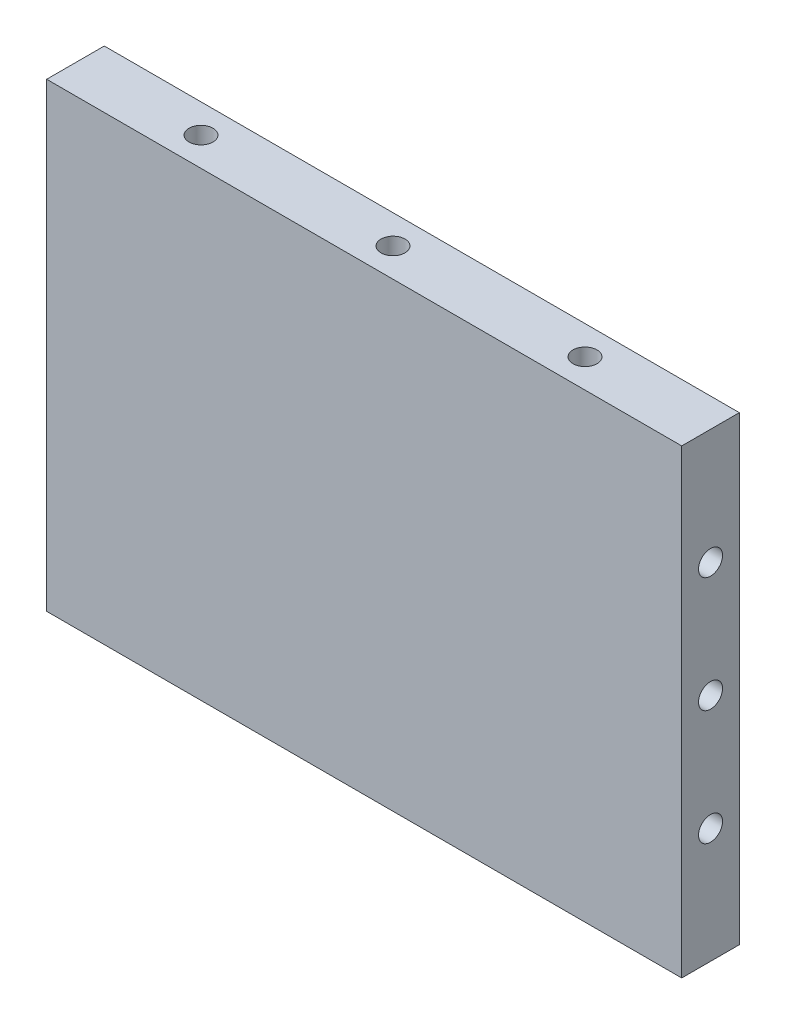
ISO-10303-21;
HEADER;
FILE_DESCRIPTION(('STEP AP214'),'2;1');
FILE_NAME('part.step','',(''),(''),'','','');
FILE_SCHEMA(('AUTOMOTIVE_DESIGN { 1 0 10303 214 1 1 1 1 }'));
ENDSEC;
DATA;
#1=APPLICATION_CONTEXT('core data for automotive mechanical design processes');
#2=APPLICATION_PROTOCOL_DEFINITION('international standard','automotive_design',2000,#1);
#3=PRODUCT_CONTEXT('',#1,'mechanical');
#4=PRODUCT('Part','Part','',(#3));
#5=PRODUCT_RELATED_PRODUCT_CATEGORY('part','',(#4));
#6=PRODUCT_DEFINITION_FORMATION('','',#4);
#7=PRODUCT_DEFINITION_CONTEXT('part definition',#1,'design');
#8=PRODUCT_DEFINITION('design','',#6,#7);
#9=PRODUCT_DEFINITION_SHAPE('','',#8);
#10=(LENGTH_UNIT() NAMED_UNIT(*) SI_UNIT(.MILLI.,.METRE.));
#11=(NAMED_UNIT(*) PLANE_ANGLE_UNIT() SI_UNIT($,.RADIAN.));
#12=(NAMED_UNIT(*) SI_UNIT($,.STERADIAN.) SOLID_ANGLE_UNIT());
#13=UNCERTAINTY_MEASURE_WITH_UNIT(LENGTH_MEASURE(1.E-05),#10,'distance_accuracy_value','');
#14=(GEOMETRIC_REPRESENTATION_CONTEXT(3) GLOBAL_UNCERTAINTY_ASSIGNED_CONTEXT((#13)) GLOBAL_UNIT_ASSIGNED_CONTEXT((#10,
#11,#12)) REPRESENTATION_CONTEXT('',''));
#15=CARTESIAN_POINT('',(0.,0.,0.));
#16=DIRECTION('',(0.,0.,1.));
#17=DIRECTION('',(1.,0.,0.));
#18=AXIS2_PLACEMENT_3D('',#15,#16,#17);
#19=CARTESIAN_POINT('',(-33.075,0.,2.99999999999295));
#20=DIRECTION('',(-1.,0.,0.));
#21=DIRECTION('',(0.,0.,1.));
#22=AXIS2_PLACEMENT_3D('',#19,#20,#21);
#23=CYLINDRICAL_SURFACE('',#22,1.24999999999999);
#24=CARTESIAN_POINT('',(0.,0.,2.99999999999648));
#25=DIRECTION('',(-0.707106781186547,-0.707106781186547,0.));
#26=DIRECTION('',(-0.707106781186547,0.707106781186547,0.));
#27=AXIS2_PLACEMENT_3D('',#24,#25,#26);
#28=ELLIPSE('',#27,1.76776695296635,1.24999999999999);
#29=CARTESIAN_POINT('',(0.,0.,1.74999999999649));
#30=VERTEX_POINT('',#29);
#31=CARTESIAN_POINT('',(0.,0.,4.24999999999646));
#32=VERTEX_POINT('',#31);
#33=EDGE_CURVE('E266',#30,#32,#28,.T.);
#34=ORIENTED_EDGE('',*,*,#33,.T.);
#35=CARTESIAN_POINT('',(0.,0.,2.99999999999648));
#36=DIRECTION('',(-0.707106781186547,0.707106781186547,0.));
#37=DIRECTION('',(-0.707106781186547,-0.707106781186547,0.));
#38=AXIS2_PLACEMENT_3D('',#35,#36,#37);
#39=ELLIPSE('',#38,1.76776695296635,1.24999999999999);
#40=EDGE_CURVE('E262',#32,#30,#39,.T.);
#41=ORIENTED_EDGE('',*,*,#40,.T.);
#42=EDGE_LOOP('',(#34,#41));
#43=FACE_BOUND('',#42,.T.);
#44=CARTESIAN_POINT('',(20.,0.,2.99999999999648));
#45=DIRECTION('',(-0.707106781186547,-0.707106781186547,0.));
#46=DIRECTION('',(-0.707106781186547,0.707106781186547,0.));
#47=AXIS2_PLACEMENT_3D('',#44,#45,#46);
#48=ELLIPSE('',#47,1.76776695296635,1.24999999999999);
#49=CARTESIAN_POINT('',(20.,0.,1.74999999999649));
#50=VERTEX_POINT('',#49);
#51=CARTESIAN_POINT('',(20.,0.,4.24999999999646));
#52=VERTEX_POINT('',#51);
#53=EDGE_CURVE('E59',#50,#52,#48,.F.);
#54=ORIENTED_EDGE('',*,*,#53,.T.);
#55=CARTESIAN_POINT('',(20.,0.,2.99999999999648));
#56=DIRECTION('',(-0.707106781186547,0.707106781186547,0.));
#57=DIRECTION('',(-0.707106781186547,-0.707106781186547,0.));
#58=AXIS2_PLACEMENT_3D('',#55,#56,#57);
#59=ELLIPSE('',#58,1.76776695296635,1.24999999999999);
#60=EDGE_CURVE('E334',#52,#50,#59,.F.);
#61=ORIENTED_EDGE('',*,*,#60,.T.);
#62=EDGE_LOOP('',(#54,#61));
#63=FACE_BOUND('',#62,.T.);
#64=ADVANCED_FACE('F44',(#43,#63),#23,.F.);
#65=CARTESIAN_POINT('',(-33.075,12.,3.));
#66=DIRECTION('',(-1.,0.,0.));
#67=DIRECTION('',(0.,0.,1.));
#68=AXIS2_PLACEMENT_3D('',#65,#66,#67);
#69=CYLINDRICAL_SURFACE('',#68,1.24999999999999);
#70=CARTESIAN_POINT('',(0.,12.,3.));
#71=DIRECTION('',(-0.707106781186547,-0.707106781186547,0.));
#72=DIRECTION('',(-0.707106781186547,0.707106781186547,0.));
#73=AXIS2_PLACEMENT_3D('',#70,#71,#72);
#74=ELLIPSE('',#73,1.76776695296635,1.24999999999999);
#75=CARTESIAN_POINT('',(0.,12.,1.75000000000001));
#76=VERTEX_POINT('',#75);
#77=CARTESIAN_POINT('',(0.,12.,4.24999999999999));
#78=VERTEX_POINT('',#77);
#79=EDGE_CURVE('E185',#76,#78,#74,.T.);
#80=ORIENTED_EDGE('',*,*,#79,.T.);
#81=CARTESIAN_POINT('',(0.,12.,3.));
#82=DIRECTION('',(-0.707106781186547,0.707106781186547,0.));
#83=DIRECTION('',(-0.707106781186547,-0.707106781186547,0.));
#84=AXIS2_PLACEMENT_3D('',#81,#82,#83);
#85=ELLIPSE('',#84,1.76776695296635,1.24999999999999);
#86=EDGE_CURVE('E181',#78,#76,#85,.T.);
#87=ORIENTED_EDGE('',*,*,#86,.T.);
#88=EDGE_LOOP('',(#80,#87));
#89=FACE_BOUND('',#88,.T.);
#90=CARTESIAN_POINT('',(20.,12.,3.));
#91=DIRECTION('',(-0.707106781186547,-0.707106781186547,0.));
#92=DIRECTION('',(-0.707106781186547,0.707106781186547,0.));
#93=AXIS2_PLACEMENT_3D('',#90,#91,#92);
#94=ELLIPSE('',#93,1.76776695296635,1.24999999999999);
#95=CARTESIAN_POINT('',(20.,12.,1.75000000000001));
#96=VERTEX_POINT('',#95);
#97=CARTESIAN_POINT('',(20.,12.,4.24999999999999));
#98=VERTEX_POINT('',#97);
#99=EDGE_CURVE('E66',#96,#98,#94,.F.);
#100=ORIENTED_EDGE('',*,*,#99,.T.);
#101=CARTESIAN_POINT('',(20.,12.,3.));
#102=DIRECTION('',(-0.707106781186547,0.707106781186547,0.));
#103=DIRECTION('',(-0.707106781186547,-0.707106781186547,0.));
#104=AXIS2_PLACEMENT_3D('',#101,#102,#103);
#105=ELLIPSE('',#104,1.76776695296635,1.24999999999999);
#106=EDGE_CURVE('E347',#98,#96,#105,.F.);
#107=ORIENTED_EDGE('',*,*,#106,.T.);
#108=EDGE_LOOP('',(#100,#107));
#109=FACE_BOUND('',#108,.T.);
#110=ADVANCED_FACE('F411',(#89,#109),#69,.F.);
#111=CARTESIAN_POINT('',(-33.075,-12.,3.));
#112=DIRECTION('',(-1.,0.,0.));
#113=DIRECTION('',(0.,0.,1.));
#114=AXIS2_PLACEMENT_3D('',#111,#112,#113);
#115=CYLINDRICAL_SURFACE('',#114,1.24999999999999);
#116=CARTESIAN_POINT('',(0.,-12.,3.));
#117=DIRECTION('',(-0.707106781186547,-0.707106781186547,0.));
#118=DIRECTION('',(-0.707106781186547,0.707106781186547,0.));
#119=AXIS2_PLACEMENT_3D('',#116,#117,#118);
#120=ELLIPSE('',#119,1.76776695296635,1.24999999999999);
#121=CARTESIAN_POINT('',(0.,-12.,1.75000000000001));
#122=VERTEX_POINT('',#121);
#123=CARTESIAN_POINT('',(0.,-12.,4.24999999999999));
#124=VERTEX_POINT('',#123);
#125=EDGE_CURVE('E281',#122,#124,#120,.T.);
#126=ORIENTED_EDGE('',*,*,#125,.T.);
#127=CARTESIAN_POINT('',(0.,-12.,3.));
#128=DIRECTION('',(-0.707106781186547,0.707106781186547,0.));
#129=DIRECTION('',(-0.707106781186547,-0.707106781186547,0.));
#130=AXIS2_PLACEMENT_3D('',#127,#128,#129);
#131=ELLIPSE('',#130,1.76776695296635,1.24999999999999);
#132=EDGE_CURVE('E277',#124,#122,#131,.T.);
#133=ORIENTED_EDGE('',*,*,#132,.T.);
#134=EDGE_LOOP('',(#126,#133));
#135=FACE_BOUND('',#134,.T.);
#136=CARTESIAN_POINT('',(20.,-12.,3.));
#137=DIRECTION('',(-0.707106781186547,-0.707106781186547,0.));
#138=DIRECTION('',(-0.707106781186547,0.707106781186547,0.));
#139=AXIS2_PLACEMENT_3D('',#136,#137,#138);
#140=ELLIPSE('',#139,1.76776695296635,1.24999999999999);
#141=CARTESIAN_POINT('',(20.,-12.,1.75000000000001));
#142=VERTEX_POINT('',#141);
#143=CARTESIAN_POINT('',(20.,-12.,4.24999999999999));
#144=VERTEX_POINT('',#143);
#145=EDGE_CURVE('E148',#142,#144,#140,.F.);
#146=ORIENTED_EDGE('',*,*,#145,.T.);
#147=CARTESIAN_POINT('',(20.,-12.,3.));
#148=DIRECTION('',(-0.707106781186547,0.707106781186547,0.));
#149=DIRECTION('',(-0.707106781186547,-0.707106781186547,0.));
#150=AXIS2_PLACEMENT_3D('',#147,#148,#149);
#151=ELLIPSE('',#150,1.76776695296635,1.24999999999999);
#152=EDGE_CURVE('E11',#144,#142,#151,.F.);
#153=ORIENTED_EDGE('',*,*,#152,.T.);
#154=EDGE_LOOP('',(#146,#153));
#155=FACE_BOUND('',#154,.T.);
#156=ADVANCED_FACE('F158',(#135,#155),#115,.F.);
#157=CARTESIAN_POINT('',(-33.075,0.,2.99999999999295));
#158=DIRECTION('',(-1.,0.,0.));
#159=DIRECTION('',(0.,0.,1.));
#160=AXIS2_PLACEMENT_3D('',#157,#158,#159);
#161=CIRCLE('',#160,1.24999999999999);
#162=CARTESIAN_POINT('',(-33.075,0.,4.24999999999294));
#163=VERTEX_POINT('',#162);
#164=EDGE_CURVE('E238',#163,#163,#161,.T.);
#165=ORIENTED_EDGE('',*,*,#164,.T.);
#166=EDGE_LOOP('',(#165));
#167=FACE_BOUND('',#166,.T.);
#168=CARTESIAN_POINT('',(-20.,0.,2.99999999999648));
#169=DIRECTION('',(-0.707106781186547,-0.707106781186547,0.));
#170=DIRECTION('',(-0.707106781186547,0.707106781186547,0.));
#171=AXIS2_PLACEMENT_3D('',#168,#169,#170);
#172=ELLIPSE('',#171,1.76776695296635,1.24999999999999);
#173=CARTESIAN_POINT('',(-20.,0.,1.74999999999649));
#174=VERTEX_POINT('',#173);
#175=CARTESIAN_POINT('',(-20.,0.,4.24999999999646));
#176=VERTEX_POINT('',#175);
#177=EDGE_CURVE('E308',#174,#176,#172,.F.);
#178=ORIENTED_EDGE('',*,*,#177,.T.);
#179=CARTESIAN_POINT('',(-20.,0.,2.99999999999648));
#180=DIRECTION('',(-0.707106781186547,0.707106781186547,0.));
#181=DIRECTION('',(-0.707106781186547,-0.707106781186547,0.));
#182=AXIS2_PLACEMENT_3D('',#179,#180,#181);
#183=ELLIPSE('',#182,1.76776695296635,1.24999999999999);
#184=EDGE_CURVE('E296',#176,#174,#183,.F.);
#185=ORIENTED_EDGE('',*,*,#184,.T.);
#186=EDGE_LOOP('',(#178,#185));
#187=FACE_BOUND('',#186,.T.);
#188=ADVANCED_FACE('F413',(#167,#187),#23,.F.);
#189=CARTESIAN_POINT('',(-33.075,-12.,3.));
#190=DIRECTION('',(-1.,0.,0.));
#191=DIRECTION('',(0.,0.,1.));
#192=AXIS2_PLACEMENT_3D('',#189,#190,#191);
#193=CIRCLE('',#192,1.24999999999999);
#194=CARTESIAN_POINT('',(-33.075,-12.,4.24999999999999));
#195=VERTEX_POINT('',#194);
#196=EDGE_CURVE('E246',#195,#195,#193,.T.);
#197=ORIENTED_EDGE('',*,*,#196,.T.);
#198=EDGE_LOOP('',(#197));
#199=FACE_BOUND('',#198,.T.);
#200=CARTESIAN_POINT('',(-20.,-12.,3.));
#201=DIRECTION('',(-0.707106781186547,-0.707106781186547,0.));
#202=DIRECTION('',(-0.707106781186547,0.707106781186547,0.));
#203=AXIS2_PLACEMENT_3D('',#200,#201,#202);
#204=ELLIPSE('',#203,1.76776695296635,1.24999999999999);
#205=CARTESIAN_POINT('',(-20.,-12.,1.75000000000001));
#206=VERTEX_POINT('',#205);
#207=CARTESIAN_POINT('',(-20.,-12.,4.24999999999999));
#208=VERTEX_POINT('',#207);
#209=EDGE_CURVE('E323',#206,#208,#204,.F.);
#210=ORIENTED_EDGE('',*,*,#209,.T.);
#211=CARTESIAN_POINT('',(-20.,-12.,3.));
#212=DIRECTION('',(-0.707106781186547,0.707106781186547,0.));
#213=DIRECTION('',(-0.707106781186547,-0.707106781186547,0.));
#214=AXIS2_PLACEMENT_3D('',#211,#212,#213);
#215=ELLIPSE('',#214,1.76776695296635,1.24999999999999);
#216=EDGE_CURVE('E311',#208,#206,#215,.F.);
#217=ORIENTED_EDGE('',*,*,#216,.T.);
#218=EDGE_LOOP('',(#210,#217));
#219=FACE_BOUND('',#218,.T.);
#220=ADVANCED_FACE('F424',(#199,#219),#115,.F.);
#221=CARTESIAN_POINT('',(-33.075,12.,3.));
#222=DIRECTION('',(-1.,0.,0.));
#223=DIRECTION('',(0.,0.,1.));
#224=AXIS2_PLACEMENT_3D('',#221,#222,#223);
#225=CIRCLE('',#224,1.24999999999999);
#226=CARTESIAN_POINT('',(-33.075,12.,4.24999999999999));
#227=VERTEX_POINT('',#226);
#228=EDGE_CURVE('E254',#227,#227,#225,.T.);
#229=ORIENTED_EDGE('',*,*,#228,.T.);
#230=EDGE_LOOP('',(#229));
#231=FACE_BOUND('',#230,.T.);
#232=CARTESIAN_POINT('',(-20.,12.,3.));
#233=DIRECTION('',(-0.707106781186547,-0.707106781186547,0.));
#234=DIRECTION('',(-0.707106781186547,0.707106781186547,0.));
#235=AXIS2_PLACEMENT_3D('',#232,#233,#234);
#236=ELLIPSE('',#235,1.76776695296635,1.24999999999999);
#237=CARTESIAN_POINT('',(-20.,12.,1.75000000000001));
#238=VERTEX_POINT('',#237);
#239=CARTESIAN_POINT('',(-20.,12.,4.24999999999999));
#240=VERTEX_POINT('',#239);
#241=EDGE_CURVE('E174',#238,#240,#236,.F.);
#242=ORIENTED_EDGE('',*,*,#241,.T.);
#243=CARTESIAN_POINT('',(-20.,12.,3.));
#244=DIRECTION('',(-0.707106781186547,0.707106781186547,0.));
#245=DIRECTION('',(-0.707106781186547,-0.707106781186547,0.));
#246=AXIS2_PLACEMENT_3D('',#243,#244,#245);
#247=ELLIPSE('',#246,1.76776695296635,1.24999999999999);
#248=EDGE_CURVE('E156',#240,#238,#247,.F.);
#249=ORIENTED_EDGE('',*,*,#248,.T.);
#250=EDGE_LOOP('',(#242,#249));
#251=FACE_BOUND('',#250,.T.);
#252=ADVANCED_FACE('F420',(#231,#251),#69,.F.);
#253=CARTESIAN_POINT('',(-20.,0.,2.99999999999648));
#254=DIRECTION('',(-0.707106781186547,-0.707106781186547,0.));
#255=DIRECTION('',(-0.707106781186547,0.707106781186547,0.));
#256=AXIS2_PLACEMENT_3D('',#253,#254,#255);
#257=ELLIPSE('',#256,1.76776695296635,1.24999999999999);
#258=EDGE_CURVE('E304',#174,#176,#257,.T.);
#259=ORIENTED_EDGE('',*,*,#258,.T.);
#260=CARTESIAN_POINT('',(-20.,0.,2.99999999999648));
#261=DIRECTION('',(-0.707106781186547,0.707106781186547,0.));
#262=DIRECTION('',(-0.707106781186547,-0.707106781186547,0.));
#263=AXIS2_PLACEMENT_3D('',#260,#261,#262);
#264=ELLIPSE('',#263,1.76776695296635,1.24999999999999);
#265=EDGE_CURVE('E300',#176,#174,#264,.T.);
#266=ORIENTED_EDGE('',*,*,#265,.T.);
#267=EDGE_LOOP('',(#259,#266));
#268=FACE_BOUND('',#267,.T.);
#269=CARTESIAN_POINT('',(0.,0.,2.99999999999648));
#270=DIRECTION('',(-0.707106781186547,-0.707106781186547,0.));
#271=DIRECTION('',(-0.707106781186547,0.707106781186547,0.));
#272=AXIS2_PLACEMENT_3D('',#269,#270,#271);
#273=ELLIPSE('',#272,1.76776695296635,1.24999999999999);
#274=EDGE_CURVE('E270',#30,#32,#273,.F.);
#275=ORIENTED_EDGE('',*,*,#274,.T.);
#276=CARTESIAN_POINT('',(0.,0.,2.99999999999648));
#277=DIRECTION('',(-0.707106781186547,0.707106781186547,0.));
#278=DIRECTION('',(-0.707106781186547,-0.707106781186547,0.));
#279=AXIS2_PLACEMENT_3D('',#276,#277,#278);
#280=ELLIPSE('',#279,1.76776695296635,1.24999999999999);
#281=EDGE_CURVE('E258',#32,#30,#280,.F.);
#282=ORIENTED_EDGE('',*,*,#281,.T.);
#283=EDGE_LOOP('',(#275,#282));
#284=FACE_BOUND('',#283,.T.);
#285=ADVANCED_FACE('F426',(#268,#284),#23,.F.);
#286=CARTESIAN_POINT('',(-20.,-12.,3.));
#287=DIRECTION('',(-0.707106781186547,-0.707106781186547,0.));
#288=DIRECTION('',(-0.707106781186547,0.707106781186547,0.));
#289=AXIS2_PLACEMENT_3D('',#286,#287,#288);
#290=ELLIPSE('',#289,1.76776695296635,1.24999999999999);
#291=EDGE_CURVE('E319',#206,#208,#290,.T.);
#292=ORIENTED_EDGE('',*,*,#291,.T.);
#293=CARTESIAN_POINT('',(-20.,-12.,3.));
#294=DIRECTION('',(-0.707106781186547,0.707106781186547,0.));
#295=DIRECTION('',(-0.707106781186547,-0.707106781186547,0.));
#296=AXIS2_PLACEMENT_3D('',#293,#294,#295);
#297=ELLIPSE('',#296,1.76776695296635,1.24999999999999);
#298=EDGE_CURVE('E315',#208,#206,#297,.T.);
#299=ORIENTED_EDGE('',*,*,#298,.T.);
#300=EDGE_LOOP('',(#292,#299));
#301=FACE_BOUND('',#300,.T.);
#302=CARTESIAN_POINT('',(0.,-12.,3.));
#303=DIRECTION('',(-0.707106781186547,-0.707106781186547,0.));
#304=DIRECTION('',(-0.707106781186547,0.707106781186547,0.));
#305=AXIS2_PLACEMENT_3D('',#302,#303,#304);
#306=ELLIPSE('',#305,1.76776695296635,1.24999999999999);
#307=EDGE_CURVE('E285',#122,#124,#306,.F.);
#308=ORIENTED_EDGE('',*,*,#307,.T.);
#309=CARTESIAN_POINT('',(0.,-12.,3.));
#310=DIRECTION('',(-0.707106781186547,0.707106781186547,0.));
#311=DIRECTION('',(-0.707106781186547,-0.707106781186547,0.));
#312=AXIS2_PLACEMENT_3D('',#309,#310,#311);
#313=ELLIPSE('',#312,1.76776695296635,1.24999999999999);
#314=EDGE_CURVE('E273',#124,#122,#313,.F.);
#315=ORIENTED_EDGE('',*,*,#314,.T.);
#316=EDGE_LOOP('',(#308,#315));
#317=FACE_BOUND('',#316,.T.);
#318=ADVANCED_FACE('F433',(#301,#317),#115,.F.);
#319=CARTESIAN_POINT('',(-20.,12.,3.));
#320=DIRECTION('',(-0.707106781186547,-0.707106781186547,0.));
#321=DIRECTION('',(-0.707106781186547,0.707106781186547,0.));
#322=AXIS2_PLACEMENT_3D('',#319,#320,#321);
#323=ELLIPSE('',#322,1.76776695296635,1.24999999999999);
#324=EDGE_CURVE('E170',#238,#240,#323,.T.);
#325=ORIENTED_EDGE('',*,*,#324,.T.);
#326=CARTESIAN_POINT('',(-20.,12.,3.));
#327=DIRECTION('',(-0.707106781186547,0.707106781186547,0.));
#328=DIRECTION('',(-0.707106781186547,-0.707106781186547,0.));
#329=AXIS2_PLACEMENT_3D('',#326,#327,#328);
#330=ELLIPSE('',#329,1.76776695296635,1.24999999999999);
#331=EDGE_CURVE('E166',#240,#238,#330,.T.);
#332=ORIENTED_EDGE('',*,*,#331,.T.);
#333=EDGE_LOOP('',(#325,#332));
#334=FACE_BOUND('',#333,.T.);
#335=CARTESIAN_POINT('',(0.,12.,3.));
#336=DIRECTION('',(-0.707106781186547,-0.707106781186547,0.));
#337=DIRECTION('',(-0.707106781186547,0.707106781186547,0.));
#338=AXIS2_PLACEMENT_3D('',#335,#336,#337);
#339=ELLIPSE('',#338,1.76776695296635,1.24999999999999);
#340=EDGE_CURVE('E189',#76,#78,#339,.F.);
#341=ORIENTED_EDGE('',*,*,#340,.T.);
#342=CARTESIAN_POINT('',(0.,12.,3.));
#343=DIRECTION('',(-0.707106781186547,0.707106781186547,0.));
#344=DIRECTION('',(-0.707106781186547,-0.707106781186547,0.));
#345=AXIS2_PLACEMENT_3D('',#342,#343,#344);
#346=ELLIPSE('',#345,1.76776695296635,1.24999999999999);
#347=EDGE_CURVE('E177',#78,#76,#346,.F.);
#348=ORIENTED_EDGE('',*,*,#347,.T.);
#349=EDGE_LOOP('',(#341,#348));
#350=FACE_BOUND('',#349,.T.);
#351=ADVANCED_FACE('F441',(#334,#350),#69,.F.);
#352=CARTESIAN_POINT('',(33.075,-24.,6.));
#353=DIRECTION('',(-1.,0.,0.));
#354=DIRECTION('',(0.,0.,1.));
#355=AXIS2_PLACEMENT_3D('',#352,#353,#354);
#356=PLANE('',#355);
#357=CARTESIAN_POINT('',(33.075,12.,3.));
#358=DIRECTION('',(-1.,0.,0.));
#359=DIRECTION('',(0.,0.,1.));
#360=AXIS2_PLACEMENT_3D('',#357,#358,#359);
#361=CIRCLE('',#360,1.24999999999998);
#362=CARTESIAN_POINT('',(33.075,12.,4.24999999999998));
#363=VERTEX_POINT('',#362);
#364=EDGE_CURVE('E250',#363,#363,#361,.T.);
#365=ORIENTED_EDGE('',*,*,#364,.T.);
#366=EDGE_LOOP('',(#365));
#367=FACE_BOUND('',#366,.T.);
#368=CARTESIAN_POINT('',(33.075,-12.,3.));
#369=DIRECTION('',(-1.,0.,0.));
#370=DIRECTION('',(0.,0.,1.));
#371=AXIS2_PLACEMENT_3D('',#368,#369,#370);
#372=CIRCLE('',#371,1.24999999999998);
#373=CARTESIAN_POINT('',(33.075,-12.,4.24999999999998));
#374=VERTEX_POINT('',#373);
#375=EDGE_CURVE('E242',#374,#374,#372,.T.);
#376=ORIENTED_EDGE('',*,*,#375,.T.);
#377=EDGE_LOOP('',(#376));
#378=FACE_BOUND('',#377,.T.);
#379=CARTESIAN_POINT('',(33.075,0.,2.99999999999295));
#380=DIRECTION('',(-1.,0.,0.));
#381=DIRECTION('',(0.,0.,1.));
#382=AXIS2_PLACEMENT_3D('',#379,#380,#381);
#383=CIRCLE('',#382,1.24999999999998);
#384=CARTESIAN_POINT('',(33.075,0.,4.24999999999293));
#385=VERTEX_POINT('',#384);
#386=EDGE_CURVE('E223',#385,#385,#383,.T.);
#387=ORIENTED_EDGE('',*,*,#386,.T.);
#388=EDGE_LOOP('',(#387));
#389=FACE_BOUND('',#388,.T.);
#390=DIRECTION('',(0.,1.,0.));
#391=VECTOR('',#390,1.);
#392=CARTESIAN_POINT('',(33.075,-24.,0.));
#393=LINE('',#392,#391);
#394=CARTESIAN_POINT('',(33.075,-24.,0.));
#395=VERTEX_POINT('',#394);
#396=CARTESIAN_POINT('',(33.075,24.,0.));
#397=VERTEX_POINT('',#396);
#398=EDGE_CURVE('E219',#395,#397,#393,.T.);
#399=ORIENTED_EDGE('',*,*,#398,.T.);
#400=DIRECTION('',(0.,0.,-1.));
#401=VECTOR('',#400,1.);
#402=CARTESIAN_POINT('',(33.075,24.,6.));
#403=LINE('',#402,#401);
#404=CARTESIAN_POINT('',(33.075,24.,6.));
#405=VERTEX_POINT('',#404);
#406=EDGE_CURVE('E192',#405,#397,#403,.T.);
#407=ORIENTED_EDGE('',*,*,#406,.F.);
#408=DIRECTION('',(0.,1.,0.));
#409=VECTOR('',#408,1.);
#410=CARTESIAN_POINT('',(33.075,-24.,6.));
#411=LINE('',#410,#409);
#412=CARTESIAN_POINT('',(33.075,-24.,6.));
#413=VERTEX_POINT('',#412);
#414=EDGE_CURVE('E212',#413,#405,#411,.T.);
#415=ORIENTED_EDGE('',*,*,#414,.F.);
#416=DIRECTION('',(0.,0.,-1.));
#417=VECTOR('',#416,1.);
#418=CARTESIAN_POINT('',(33.075,-24.,6.));
#419=LINE('',#418,#417);
#420=EDGE_CURVE('E204',#413,#395,#419,.T.);
#421=ORIENTED_EDGE('',*,*,#420,.T.);
#422=EDGE_LOOP('',(#399,#407,#415,#421));
#423=FACE_BOUND('',#422,.T.);
#424=ADVANCED_FACE('F46',(#367,#378,#389,#423),#356,.F.);
#425=CARTESIAN_POINT('',(-33.075,24.,6.));
#426=DIRECTION('',(0.,-1.,0.));
#427=DIRECTION('',(0.,0.,-1.));
#428=AXIS2_PLACEMENT_3D('',#425,#426,#427);
#429=PLANE('',#428);
#430=CARTESIAN_POINT('',(20.,24.,3.));
#431=DIRECTION('',(0.,1.,0.));
#432=DIRECTION('',(0.,0.,1.));
#433=AXIS2_PLACEMENT_3D('',#430,#431,#432);
#434=CIRCLE('',#433,1.24999999999999);
#435=CARTESIAN_POINT('',(20.,24.,4.24999999999999));
#436=VERTEX_POINT('',#435);
#437=EDGE_CURVE('E364',#436,#436,#434,.T.);
#438=ORIENTED_EDGE('',*,*,#437,.F.);
#439=EDGE_LOOP('',(#438));
#440=FACE_BOUND('',#439,.T.);
#441=CARTESIAN_POINT('',(-20.,24.,3.));
#442=DIRECTION('',(0.,1.,0.));
#443=DIRECTION('',(0.,0.,1.));
#444=AXIS2_PLACEMENT_3D('',#441,#442,#443);
#445=CIRCLE('',#444,1.24999999999999);
#446=CARTESIAN_POINT('',(-20.,24.,4.24999999999999));
#447=VERTEX_POINT('',#446);
#448=EDGE_CURVE('E330',#447,#447,#445,.T.);
#449=ORIENTED_EDGE('',*,*,#448,.F.);
#450=EDGE_LOOP('',(#449));
#451=FACE_BOUND('',#450,.T.);
#452=CARTESIAN_POINT('',(0.,24.,3.));
#453=DIRECTION('',(0.,1.,0.));
#454=DIRECTION('',(0.,0.,1.));
#455=AXIS2_PLACEMENT_3D('',#452,#453,#454);
#456=CIRCLE('',#455,1.24999999999999);
#457=CARTESIAN_POINT('',(0.,24.,4.24999999999999));
#458=VERTEX_POINT('',#457);
#459=EDGE_CURVE('E292',#458,#458,#456,.T.);
#460=ORIENTED_EDGE('',*,*,#459,.F.);
#461=EDGE_LOOP('',(#460));
#462=FACE_BOUND('',#461,.T.);
#463=DIRECTION('',(-1.,0.,0.));
#464=VECTOR('',#463,1.);
#465=CARTESIAN_POINT('',(-33.075,24.,0.));
#466=LINE('',#465,#464);
#467=CARTESIAN_POINT('',(-33.075,24.,0.));
#468=VERTEX_POINT('',#467);
#469=EDGE_CURVE('E216',#397,#468,#466,.T.);
#470=ORIENTED_EDGE('',*,*,#469,.T.);
#471=DIRECTION('',(0.,0.,-1.));
#472=VECTOR('',#471,1.);
#473=CARTESIAN_POINT('',(-33.075,24.,6.));
#474=LINE('',#473,#472);
#475=CARTESIAN_POINT('',(-33.075,24.,6.));
#476=VERTEX_POINT('',#475);
#477=EDGE_CURVE('E196',#476,#468,#474,.T.);
#478=ORIENTED_EDGE('',*,*,#477,.F.);
#479=DIRECTION('',(-1.,0.,0.));
#480=VECTOR('',#479,1.);
#481=CARTESIAN_POINT('',(-33.075,24.,6.));
#482=LINE('',#481,#480);
#483=EDGE_CURVE('E229',#405,#476,#482,.T.);
#484=ORIENTED_EDGE('',*,*,#483,.F.);
#485=ORIENTED_EDGE('',*,*,#406,.T.);
#486=EDGE_LOOP('',(#470,#478,#484,#485));
#487=FACE_BOUND('',#486,.T.);
#488=ADVANCED_FACE('F372',(#440,#451,#462,#487),#429,.F.);
#489=CARTESIAN_POINT('',(-33.075,-24.,6.));
#490=DIRECTION('',(1.,0.,0.));
#491=DIRECTION('',(0.,0.,-1.));
#492=AXIS2_PLACEMENT_3D('',#489,#490,#491);
#493=PLANE('',#492);
#494=ORIENTED_EDGE('',*,*,#228,.F.);
#495=EDGE_LOOP('',(#494));
#496=FACE_BOUND('',#495,.T.);
#497=ORIENTED_EDGE('',*,*,#196,.F.);
#498=EDGE_LOOP('',(#497));
#499=FACE_BOUND('',#498,.T.);
#500=ORIENTED_EDGE('',*,*,#164,.F.);
#501=EDGE_LOOP('',(#500));
#502=FACE_BOUND('',#501,.T.);
#503=DIRECTION('',(0.,-1.,0.));
#504=VECTOR('',#503,1.);
#505=CARTESIAN_POINT('',(-33.075,-24.,0.));
#506=LINE('',#505,#504);
#507=CARTESIAN_POINT('',(-33.075,-24.,0.));
#508=VERTEX_POINT('',#507);
#509=EDGE_CURVE('E213',#468,#508,#506,.T.);
#510=ORIENTED_EDGE('',*,*,#509,.T.);
#511=DIRECTION('',(0.,0.,-1.));
#512=VECTOR('',#511,1.);
#513=CARTESIAN_POINT('',(-33.075,-24.,6.));
#514=LINE('',#513,#512);
#515=CARTESIAN_POINT('',(-33.075,-24.,6.));
#516=VERTEX_POINT('',#515);
#517=EDGE_CURVE('E200',#516,#508,#514,.T.);
#518=ORIENTED_EDGE('',*,*,#517,.F.);
#519=DIRECTION('',(0.,-1.,0.));
#520=VECTOR('',#519,1.);
#521=CARTESIAN_POINT('',(-33.075,-24.,6.));
#522=LINE('',#521,#520);
#523=EDGE_CURVE('E226',#476,#516,#522,.T.);
#524=ORIENTED_EDGE('',*,*,#523,.F.);
#525=ORIENTED_EDGE('',*,*,#477,.T.);
#526=EDGE_LOOP('',(#510,#518,#524,#525));
#527=FACE_BOUND('',#526,.T.);
#528=ADVANCED_FACE('F375',(#496,#499,#502,#527),#493,.F.);
#529=CARTESIAN_POINT('',(-33.075,-24.,6.));
#530=DIRECTION('',(0.,1.,0.));
#531=DIRECTION('',(0.,0.,1.));
#532=AXIS2_PLACEMENT_3D('',#529,#530,#531);
#533=PLANE('',#532);
#534=CARTESIAN_POINT('',(20.,-24.,3.));
#535=DIRECTION('',(0.,1.,0.));
#536=DIRECTION('',(0.,0.,1.));
#537=AXIS2_PLACEMENT_3D('',#534,#535,#536);
#538=CIRCLE('',#537,1.24999999999999);
#539=CARTESIAN_POINT('',(20.,-24.,4.24999999999999));
#540=VERTEX_POINT('',#539);
#541=EDGE_CURVE('E360',#540,#540,#538,.T.);
#542=ORIENTED_EDGE('',*,*,#541,.T.);
#543=EDGE_LOOP('',(#542));
#544=FACE_BOUND('',#543,.T.);
#545=CARTESIAN_POINT('',(-20.,-24.,3.));
#546=DIRECTION('',(0.,1.,0.));
#547=DIRECTION('',(0.,0.,1.));
#548=AXIS2_PLACEMENT_3D('',#545,#546,#547);
#549=CIRCLE('',#548,1.24999999999999);
#550=CARTESIAN_POINT('',(-20.,-24.,4.24999999999999));
#551=VERTEX_POINT('',#550);
#552=EDGE_CURVE('E326',#551,#551,#549,.T.);
#553=ORIENTED_EDGE('',*,*,#552,.T.);
#554=EDGE_LOOP('',(#553));
#555=FACE_BOUND('',#554,.T.);
#556=CARTESIAN_POINT('',(0.,-24.,3.));
#557=DIRECTION('',(0.,1.,0.));
#558=DIRECTION('',(0.,0.,1.));
#559=AXIS2_PLACEMENT_3D('',#556,#557,#558);
#560=CIRCLE('',#559,1.24999999999999);
#561=CARTESIAN_POINT('',(0.,-24.,4.24999999999999));
#562=VERTEX_POINT('',#561);
#563=EDGE_CURVE('E288',#562,#562,#560,.T.);
#564=ORIENTED_EDGE('',*,*,#563,.T.);
#565=EDGE_LOOP('',(#564));
#566=FACE_BOUND('',#565,.T.);
#567=DIRECTION('',(1.,0.,0.));
#568=VECTOR('',#567,1.);
#569=CARTESIAN_POINT('',(-33.075,-24.,0.));
#570=LINE('',#569,#568);
#571=EDGE_CURVE('E209',#508,#395,#570,.T.);
#572=ORIENTED_EDGE('',*,*,#571,.T.);
#573=ORIENTED_EDGE('',*,*,#420,.F.);
#574=DIRECTION('',(1.,0.,0.));
#575=VECTOR('',#574,1.);
#576=CARTESIAN_POINT('',(-33.075,-24.,6.));
#577=LINE('',#576,#575);
#578=EDGE_CURVE('E208',#516,#413,#577,.T.);
#579=ORIENTED_EDGE('',*,*,#578,.F.);
#580=ORIENTED_EDGE('',*,*,#517,.T.);
#581=EDGE_LOOP('',(#572,#573,#579,#580));
#582=FACE_BOUND('',#581,.T.);
#583=ADVANCED_FACE('F392',(#544,#555,#566,#582),#533,.F.);
#584=CARTESIAN_POINT('',(0.,0.,6.));
#585=DIRECTION('',(0.,0.,-1.));
#586=DIRECTION('',(-1.,0.,0.));
#587=AXIS2_PLACEMENT_3D('',#584,#585,#586);
#588=PLANE('',#587);
#589=ORIENTED_EDGE('',*,*,#414,.T.);
#590=ORIENTED_EDGE('',*,*,#483,.T.);
#591=ORIENTED_EDGE('',*,*,#523,.T.);
#592=ORIENTED_EDGE('',*,*,#578,.T.);
#593=EDGE_LOOP('',(#589,#590,#591,#592));
#594=FACE_BOUND('',#593,.T.);
#595=ADVANCED_FACE('F397',(#594),#588,.F.);
#596=CARTESIAN_POINT('',(0.,0.,0.));
#597=DIRECTION('',(0.,0.,-1.));
#598=DIRECTION('',(-1.,0.,0.));
#599=AXIS2_PLACEMENT_3D('',#596,#597,#598);
#600=PLANE('',#599);
#601=ORIENTED_EDGE('',*,*,#398,.F.);
#602=ORIENTED_EDGE('',*,*,#571,.F.);
#603=ORIENTED_EDGE('',*,*,#509,.F.);
#604=ORIENTED_EDGE('',*,*,#469,.F.);
#605=EDGE_LOOP('',(#601,#602,#603,#604));
#606=FACE_BOUND('',#605,.T.);
#607=ADVANCED_FACE('F389',(#606),#600,.T.);
#608=CARTESIAN_POINT('',(20.,0.,2.99999999999648));
#609=DIRECTION('',(-0.707106781186547,-0.707106781186547,0.));
#610=DIRECTION('',(-0.707106781186547,0.707106781186547,0.));
#611=AXIS2_PLACEMENT_3D('',#608,#609,#610);
#612=ELLIPSE('',#611,1.76776695296635,1.24999999999999);
#613=EDGE_CURVE('E341',#50,#52,#612,.T.);
#614=ORIENTED_EDGE('',*,*,#613,.T.);
#615=CARTESIAN_POINT('',(20.,0.,2.99999999999648));
#616=DIRECTION('',(-0.707106781186547,0.707106781186547,0.));
#617=DIRECTION('',(-0.707106781186547,-0.707106781186547,0.));
#618=AXIS2_PLACEMENT_3D('',#615,#616,#617);
#619=ELLIPSE('',#618,1.76776695296635,1.24999999999999);
#620=EDGE_CURVE('E337',#52,#50,#619,.T.);
#621=ORIENTED_EDGE('',*,*,#620,.T.);
#622=EDGE_LOOP('',(#614,#621));
#623=FACE_BOUND('',#622,.T.);
#624=ORIENTED_EDGE('',*,*,#386,.F.);
#625=EDGE_LOOP('',(#624));
#626=FACE_BOUND('',#625,.T.);
#627=ADVANCED_FACE('F404',(#623,#626),#23,.F.);
#628=CARTESIAN_POINT('',(20.,-12.,3.));
#629=DIRECTION('',(-0.707106781186547,-0.707106781186547,0.));
#630=DIRECTION('',(-0.707106781186547,0.707106781186547,0.));
#631=AXIS2_PLACEMENT_3D('',#628,#629,#630);
#632=ELLIPSE('',#631,1.76776695296635,1.24999999999999);
#633=EDGE_CURVE('E142',#142,#144,#632,.T.);
#634=ORIENTED_EDGE('',*,*,#633,.T.);
#635=CARTESIAN_POINT('',(20.,-12.,3.));
#636=DIRECTION('',(-0.707106781186547,0.707106781186547,0.));
#637=DIRECTION('',(-0.707106781186547,-0.707106781186547,0.));
#638=AXIS2_PLACEMENT_3D('',#635,#636,#637);
#639=ELLIPSE('',#638,1.76776695296635,1.24999999999999);
#640=EDGE_CURVE('E53',#144,#142,#639,.T.);
#641=ORIENTED_EDGE('',*,*,#640,.T.);
#642=EDGE_LOOP('',(#634,#641));
#643=FACE_BOUND('',#642,.T.);
#644=ORIENTED_EDGE('',*,*,#375,.F.);
#645=EDGE_LOOP('',(#644));
#646=FACE_BOUND('',#645,.T.);
#647=ADVANCED_FACE('F159',(#643,#646),#115,.F.);
#648=CARTESIAN_POINT('',(20.,12.,3.));
#649=DIRECTION('',(-0.707106781186547,-0.707106781186547,0.));
#650=DIRECTION('',(-0.707106781186547,0.707106781186547,0.));
#651=AXIS2_PLACEMENT_3D('',#648,#649,#650);
#652=ELLIPSE('',#651,1.76776695296635,1.24999999999999);
#653=EDGE_CURVE('E354',#96,#98,#652,.T.);
#654=ORIENTED_EDGE('',*,*,#653,.T.);
#655=CARTESIAN_POINT('',(20.,12.,3.));
#656=DIRECTION('',(-0.707106781186547,0.707106781186547,0.));
#657=DIRECTION('',(-0.707106781186547,-0.707106781186547,0.));
#658=AXIS2_PLACEMENT_3D('',#655,#656,#657);
#659=ELLIPSE('',#658,1.76776695296635,1.24999999999999);
#660=EDGE_CURVE('E350',#98,#96,#659,.T.);
#661=ORIENTED_EDGE('',*,*,#660,.T.);
#662=EDGE_LOOP('',(#654,#661));
#663=FACE_BOUND('',#662,.T.);
#664=ORIENTED_EDGE('',*,*,#364,.F.);
#665=EDGE_LOOP('',(#664));
#666=FACE_BOUND('',#665,.T.);
#667=ADVANCED_FACE('F421',(#663,#666),#69,.F.);
#668=CARTESIAN_POINT('',(0.,24.,3.));
#669=DIRECTION('',(0.,1.,0.));
#670=DIRECTION('',(0.,0.,1.));
#671=AXIS2_PLACEMENT_3D('',#668,#669,#670);
#672=CYLINDRICAL_SURFACE('',#671,1.24999999999999);
#673=ORIENTED_EDGE('',*,*,#459,.T.);
#674=EDGE_LOOP('',(#673));
#675=FACE_BOUND('',#674,.T.);
#676=ORIENTED_EDGE('',*,*,#340,.F.);
#677=ORIENTED_EDGE('',*,*,#86,.F.);
#678=EDGE_LOOP('',(#676,#677));
#679=FACE_BOUND('',#678,.T.);
#680=ADVANCED_FACE('F457',(#675,#679),#672,.F.);
#681=ORIENTED_EDGE('',*,*,#79,.F.);
#682=ORIENTED_EDGE('',*,*,#347,.F.);
#683=EDGE_LOOP('',(#681,#682));
#684=FACE_BOUND('',#683,.T.);
#685=ORIENTED_EDGE('',*,*,#274,.F.);
#686=ORIENTED_EDGE('',*,*,#40,.F.);
#687=EDGE_LOOP('',(#685,#686));
#688=FACE_BOUND('',#687,.T.);
#689=ADVANCED_FACE('F450',(#684,#688),#672,.F.);
#690=ORIENTED_EDGE('',*,*,#307,.F.);
#691=ORIENTED_EDGE('',*,*,#132,.F.);
#692=EDGE_LOOP('',(#690,#691));
#693=FACE_BOUND('',#692,.T.);
#694=ORIENTED_EDGE('',*,*,#33,.F.);
#695=ORIENTED_EDGE('',*,*,#281,.F.);
#696=EDGE_LOOP('',(#694,#695));
#697=FACE_BOUND('',#696,.T.);
#698=ADVANCED_FACE('F452',(#693,#697),#672,.F.);
#699=ORIENTED_EDGE('',*,*,#563,.F.);
#700=EDGE_LOOP('',(#699));
#701=FACE_BOUND('',#700,.T.);
#702=ORIENTED_EDGE('',*,*,#125,.F.);
#703=ORIENTED_EDGE('',*,*,#314,.F.);
#704=EDGE_LOOP('',(#702,#703));
#705=FACE_BOUND('',#704,.T.);
#706=ADVANCED_FACE('F454',(#701,#705),#672,.F.);
#707=CARTESIAN_POINT('',(-20.,24.,3.));
#708=DIRECTION('',(0.,1.,0.));
#709=DIRECTION('',(0.,0.,1.));
#710=AXIS2_PLACEMENT_3D('',#707,#708,#709);
#711=CYLINDRICAL_SURFACE('',#710,1.24999999999999);
#712=ORIENTED_EDGE('',*,*,#448,.T.);
#713=EDGE_LOOP('',(#712));
#714=FACE_BOUND('',#713,.T.);
#715=ORIENTED_EDGE('',*,*,#241,.F.);
#716=ORIENTED_EDGE('',*,*,#331,.F.);
#717=EDGE_LOOP('',(#715,#716));
#718=FACE_BOUND('',#717,.T.);
#719=ADVANCED_FACE('F462',(#714,#718),#711,.F.);
#720=ORIENTED_EDGE('',*,*,#324,.F.);
#721=ORIENTED_EDGE('',*,*,#248,.F.);
#722=EDGE_LOOP('',(#720,#721));
#723=FACE_BOUND('',#722,.T.);
#724=ORIENTED_EDGE('',*,*,#177,.F.);
#725=ORIENTED_EDGE('',*,*,#265,.F.);
#726=EDGE_LOOP('',(#724,#725));
#727=FACE_BOUND('',#726,.T.);
#728=ADVANCED_FACE('F488',(#723,#727),#711,.F.);
#729=ORIENTED_EDGE('',*,*,#209,.F.);
#730=ORIENTED_EDGE('',*,*,#298,.F.);
#731=EDGE_LOOP('',(#729,#730));
#732=FACE_BOUND('',#731,.T.);
#733=ORIENTED_EDGE('',*,*,#258,.F.);
#734=ORIENTED_EDGE('',*,*,#184,.F.);
#735=EDGE_LOOP('',(#733,#734));
#736=FACE_BOUND('',#735,.T.);
#737=ADVANCED_FACE('F494',(#732,#736),#711,.F.);
#738=ORIENTED_EDGE('',*,*,#552,.F.);
#739=EDGE_LOOP('',(#738));
#740=FACE_BOUND('',#739,.T.);
#741=ORIENTED_EDGE('',*,*,#291,.F.);
#742=ORIENTED_EDGE('',*,*,#216,.F.);
#743=EDGE_LOOP('',(#741,#742));
#744=FACE_BOUND('',#743,.T.);
#745=ADVANCED_FACE('F495',(#740,#744),#711,.F.);
#746=CARTESIAN_POINT('',(20.,24.,3.));
#747=DIRECTION('',(0.,1.,0.));
#748=DIRECTION('',(0.,0.,1.));
#749=AXIS2_PLACEMENT_3D('',#746,#747,#748);
#750=CYLINDRICAL_SURFACE('',#749,1.24999999999999);
#751=ORIENTED_EDGE('',*,*,#145,.F.);
#752=ORIENTED_EDGE('',*,*,#640,.F.);
#753=EDGE_LOOP('',(#751,#752));
#754=FACE_BOUND('',#753,.T.);
#755=ORIENTED_EDGE('',*,*,#613,.F.);
#756=ORIENTED_EDGE('',*,*,#60,.F.);
#757=EDGE_LOOP('',(#755,#756));
#758=FACE_BOUND('',#757,.T.);
#759=ADVANCED_FACE('F152',(#754,#758),#750,.F.);
#760=ORIENTED_EDGE('',*,*,#437,.T.);
#761=EDGE_LOOP('',(#760));
#762=FACE_BOUND('',#761,.T.);
#763=ORIENTED_EDGE('',*,*,#99,.F.);
#764=ORIENTED_EDGE('',*,*,#660,.F.);
#765=EDGE_LOOP('',(#763,#764));
#766=FACE_BOUND('',#765,.T.);
#767=ADVANCED_FACE('F369',(#762,#766),#750,.F.);
#768=ORIENTED_EDGE('',*,*,#541,.F.);
#769=EDGE_LOOP('',(#768));
#770=FACE_BOUND('',#769,.T.);
#771=ORIENTED_EDGE('',*,*,#633,.F.);
#772=ORIENTED_EDGE('',*,*,#152,.F.);
#773=EDGE_LOOP('',(#771,#772));
#774=FACE_BOUND('',#773,.T.);
#775=ADVANCED_FACE('F144',(#770,#774),#750,.F.);
#776=ORIENTED_EDGE('',*,*,#653,.F.);
#777=ORIENTED_EDGE('',*,*,#106,.F.);
#778=EDGE_LOOP('',(#776,#777));
#779=FACE_BOUND('',#778,.T.);
#780=ORIENTED_EDGE('',*,*,#53,.F.);
#781=ORIENTED_EDGE('',*,*,#620,.F.);
#782=EDGE_LOOP('',(#780,#781));
#783=FACE_BOUND('',#782,.T.);
#784=ADVANCED_FACE('F506',(#779,#783),#750,.F.);
#785=CLOSED_SHELL('',(#64,#110,#156,#188,#220,#252,#285,#318,#351,#424,#488,#528,#583,#595,#607,
#627,#647,#667,#680,#689,#698,#706,#719,#728,#737,#745,#759,#767,#775,#784));
#786=MANIFOLD_SOLID_BREP('B2',#785);
#787=ADVANCED_BREP_SHAPE_REPRESENTATION('',(#18,#786),#14);
#788=SHAPE_DEFINITION_REPRESENTATION(#9,#787);
ENDSEC;
END-ISO-10303-21;
